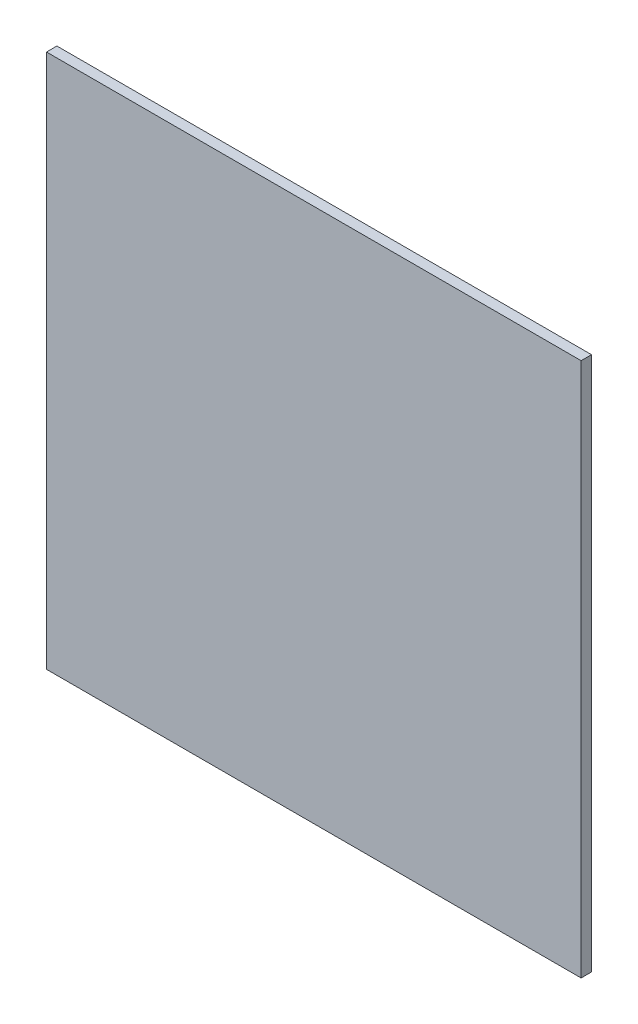
ISO-10303-21;
HEADER;
FILE_DESCRIPTION(('STEP AP214'),'2;1');
FILE_NAME('part.step','',(''),(''),'','','');
FILE_SCHEMA(('AUTOMOTIVE_DESIGN { 1 0 10303 214 1 1 1 1 }'));
ENDSEC;
DATA;
#1=APPLICATION_CONTEXT('core data for automotive mechanical design processes');
#2=APPLICATION_PROTOCOL_DEFINITION('international standard','automotive_design',2000,#1);
#3=PRODUCT_CONTEXT('',#1,'mechanical');
#4=PRODUCT('Part','Part','',(#3));
#5=PRODUCT_RELATED_PRODUCT_CATEGORY('part','',(#4));
#6=PRODUCT_DEFINITION_FORMATION('','',#4);
#7=PRODUCT_DEFINITION_CONTEXT('part definition',#1,'design');
#8=PRODUCT_DEFINITION('design','',#6,#7);
#9=PRODUCT_DEFINITION_SHAPE('','',#8);
#10=(LENGTH_UNIT() NAMED_UNIT(*) SI_UNIT(.MILLI.,.METRE.));
#11=(NAMED_UNIT(*) PLANE_ANGLE_UNIT() SI_UNIT($,.RADIAN.));
#12=(NAMED_UNIT(*) SI_UNIT($,.STERADIAN.) SOLID_ANGLE_UNIT());
#13=UNCERTAINTY_MEASURE_WITH_UNIT(LENGTH_MEASURE(1.E-05),#10,'distance_accuracy_value','');
#14=(GEOMETRIC_REPRESENTATION_CONTEXT(3) GLOBAL_UNCERTAINTY_ASSIGNED_CONTEXT((#13)) GLOBAL_UNIT_ASSIGNED_CONTEXT((#10,
#11,#12)) REPRESENTATION_CONTEXT('',''));
#15=CARTESIAN_POINT('',(0.,0.,0.));
#16=DIRECTION('',(0.,0.,1.));
#17=DIRECTION('',(1.,0.,0.));
#18=AXIS2_PLACEMENT_3D('',#15,#16,#17);
#19=CARTESIAN_POINT('',(-44.45,-44.45,1.7272));
#20=DIRECTION('',(1.,0.,0.));
#21=DIRECTION('',(0.,0.,-1.));
#22=AXIS2_PLACEMENT_3D('',#19,#20,#21);
#23=PLANE('',#22);
#24=DIRECTION('',(0.,-1.,0.));
#25=VECTOR('',#24,1.);
#26=CARTESIAN_POINT('',(-44.45,-44.45,0.));
#27=LINE('',#26,#25);
#28=CARTESIAN_POINT('',(-44.45,44.45,0.));
#29=VERTEX_POINT('',#28);
#30=CARTESIAN_POINT('',(-44.45,-44.45,0.));
#31=VERTEX_POINT('',#30);
#32=EDGE_CURVE('E404',#29,#31,#27,.T.);
#33=ORIENTED_EDGE('',*,*,#32,.T.);
#34=DIRECTION('',(0.,0.,-1.));
#35=VECTOR('',#34,1.);
#36=CARTESIAN_POINT('',(-44.45,-44.45,1.7272));
#37=LINE('',#36,#35);
#38=CARTESIAN_POINT('',(-44.45,-44.45,1.7272));
#39=VERTEX_POINT('',#38);
#40=EDGE_CURVE('E11',#39,#31,#37,.T.);
#41=ORIENTED_EDGE('',*,*,#40,.F.);
#42=DIRECTION('',(0.,-1.,0.));
#43=VECTOR('',#42,1.);
#44=CARTESIAN_POINT('',(-44.45,-44.45,1.7272));
#45=LINE('',#44,#43);
#46=CARTESIAN_POINT('',(-44.45,44.45,1.7272));
#47=VERTEX_POINT('',#46);
#48=EDGE_CURVE('E422',#47,#39,#45,.T.);
#49=ORIENTED_EDGE('',*,*,#48,.F.);
#50=DIRECTION('',(0.,0.,-1.));
#51=VECTOR('',#50,1.);
#52=CARTESIAN_POINT('',(-44.45,44.45,1.7272));
#53=LINE('',#52,#51);
#54=EDGE_CURVE('E416',#47,#29,#53,.T.);
#55=ORIENTED_EDGE('',*,*,#54,.T.);
#56=EDGE_LOOP('',(#33,#41,#49,#55));
#57=FACE_BOUND('',#56,.T.);
#58=ADVANCED_FACE('F360',(#57),#23,.F.);
#59=CARTESIAN_POINT('',(-44.45,-44.45,1.7272));
#60=DIRECTION('',(0.,1.,0.));
#61=DIRECTION('',(0.,0.,1.));
#62=AXIS2_PLACEMENT_3D('',#59,#60,#61);
#63=PLANE('',#62);
#64=DIRECTION('',(1.,0.,0.));
#65=VECTOR('',#64,1.);
#66=CARTESIAN_POINT('',(-44.45,-44.45,0.));
#67=LINE('',#66,#65);
#68=CARTESIAN_POINT('',(44.45,-44.45,0.));
#69=VERTEX_POINT('',#68);
#70=EDGE_CURVE('E400',#31,#69,#67,.T.);
#71=ORIENTED_EDGE('',*,*,#70,.T.);
#72=DIRECTION('',(0.,0.,-1.));
#73=VECTOR('',#72,1.);
#74=CARTESIAN_POINT('',(44.45,-44.45,1.7272));
#75=LINE('',#74,#73);
#76=CARTESIAN_POINT('',(44.45,-44.45,1.7272));
#77=VERTEX_POINT('',#76);
#78=EDGE_CURVE('E367',#77,#69,#75,.T.);
#79=ORIENTED_EDGE('',*,*,#78,.F.);
#80=DIRECTION('',(1.,0.,0.));
#81=VECTOR('',#80,1.);
#82=CARTESIAN_POINT('',(-44.45,-44.45,1.7272));
#83=LINE('',#82,#81);
#84=EDGE_CURVE('E412',#39,#77,#83,.T.);
#85=ORIENTED_EDGE('',*,*,#84,.F.);
#86=ORIENTED_EDGE('',*,*,#40,.T.);
#87=EDGE_LOOP('',(#71,#79,#85,#86));
#88=FACE_BOUND('',#87,.T.);
#89=ADVANCED_FACE('F411',(#88),#63,.F.);
#90=CARTESIAN_POINT('',(44.45,-44.45,1.7272));
#91=DIRECTION('',(-1.,0.,0.));
#92=DIRECTION('',(0.,0.,1.));
#93=AXIS2_PLACEMENT_3D('',#90,#91,#92);
#94=PLANE('',#93);
#95=DIRECTION('',(0.,1.,0.));
#96=VECTOR('',#95,1.);
#97=CARTESIAN_POINT('',(44.45,-44.45,0.));
#98=LINE('',#97,#96);
#99=CARTESIAN_POINT('',(44.45,44.45,0.));
#100=VERTEX_POINT('',#99);
#101=EDGE_CURVE('E405',#69,#100,#98,.T.);
#102=ORIENTED_EDGE('',*,*,#101,.T.);
#103=DIRECTION('',(0.,0.,-1.));
#104=VECTOR('',#103,1.);
#105=CARTESIAN_POINT('',(44.45,44.45,1.7272));
#106=LINE('',#105,#104);
#107=CARTESIAN_POINT('',(44.45,44.45,1.7272));
#108=VERTEX_POINT('',#107);
#109=EDGE_CURVE('E428',#108,#100,#106,.T.);
#110=ORIENTED_EDGE('',*,*,#109,.F.);
#111=DIRECTION('',(0.,1.,0.));
#112=VECTOR('',#111,1.);
#113=CARTESIAN_POINT('',(44.45,-44.45,1.7272));
#114=LINE('',#113,#112);
#115=EDGE_CURVE('E379',#77,#108,#114,.T.);
#116=ORIENTED_EDGE('',*,*,#115,.F.);
#117=ORIENTED_EDGE('',*,*,#78,.T.);
#118=EDGE_LOOP('',(#102,#110,#116,#117));
#119=FACE_BOUND('',#118,.T.);
#120=ADVANCED_FACE('F431',(#119),#94,.F.);
#121=CARTESIAN_POINT('',(-44.45,44.45,1.7272));
#122=DIRECTION('',(0.,-1.,0.));
#123=DIRECTION('',(0.,0.,-1.));
#124=AXIS2_PLACEMENT_3D('',#121,#122,#123);
#125=PLANE('',#124);
#126=DIRECTION('',(-1.,0.,0.));
#127=VECTOR('',#126,1.);
#128=CARTESIAN_POINT('',(-44.45,44.45,0.));
#129=LINE('',#128,#127);
#130=EDGE_CURVE('E420',#100,#29,#129,.T.);
#131=ORIENTED_EDGE('',*,*,#130,.T.);
#132=ORIENTED_EDGE('',*,*,#54,.F.);
#133=DIRECTION('',(-1.,0.,0.));
#134=VECTOR('',#133,1.);
#135=CARTESIAN_POINT('',(-44.45,44.45,1.7272));
#136=LINE('',#135,#134);
#137=EDGE_CURVE('E374',#108,#47,#136,.T.);
#138=ORIENTED_EDGE('',*,*,#137,.F.);
#139=ORIENTED_EDGE('',*,*,#109,.T.);
#140=EDGE_LOOP('',(#131,#132,#138,#139));
#141=FACE_BOUND('',#140,.T.);
#142=ADVANCED_FACE('F433',(#141),#125,.F.);
#143=CARTESIAN_POINT('',(-44.45,44.45,1.7272));
#144=DIRECTION('',(0.,0.,-1.));
#145=DIRECTION('',(-1.,0.,0.));
#146=AXIS2_PLACEMENT_3D('',#143,#144,#145);
#147=PLANE('',#146);
#148=ORIENTED_EDGE('',*,*,#48,.T.);
#149=ORIENTED_EDGE('',*,*,#84,.T.);
#150=ORIENTED_EDGE('',*,*,#115,.T.);
#151=ORIENTED_EDGE('',*,*,#137,.T.);
#152=EDGE_LOOP('',(#148,#149,#150,#151));
#153=FACE_BOUND('',#152,.T.);
#154=ADVANCED_FACE('F434',(#153),#147,.F.);
#155=CARTESIAN_POINT('',(-44.45,44.45,0.));
#156=DIRECTION('',(0.,0.,-1.));
#157=DIRECTION('',(-1.,0.,0.));
#158=AXIS2_PLACEMENT_3D('',#155,#156,#157);
#159=PLANE('',#158);
#160=ORIENTED_EDGE('',*,*,#32,.F.);
#161=ORIENTED_EDGE('',*,*,#130,.F.);
#162=ORIENTED_EDGE('',*,*,#101,.F.);
#163=ORIENTED_EDGE('',*,*,#70,.F.);
#164=EDGE_LOOP('',(#160,#161,#162,#163));
#165=FACE_BOUND('',#164,.T.);
#166=ADVANCED_FACE('F401',(#165),#159,.T.);
#167=CLOSED_SHELL('',(#58,#89,#120,#142,#154,#166));
#168=MANIFOLD_SOLID_BREP('B2',#167);
#169=ADVANCED_BREP_SHAPE_REPRESENTATION('',(#18,#168),#14);
#170=SHAPE_DEFINITION_REPRESENTATION(#9,#169);
ENDSEC;
END-ISO-10303-21;
